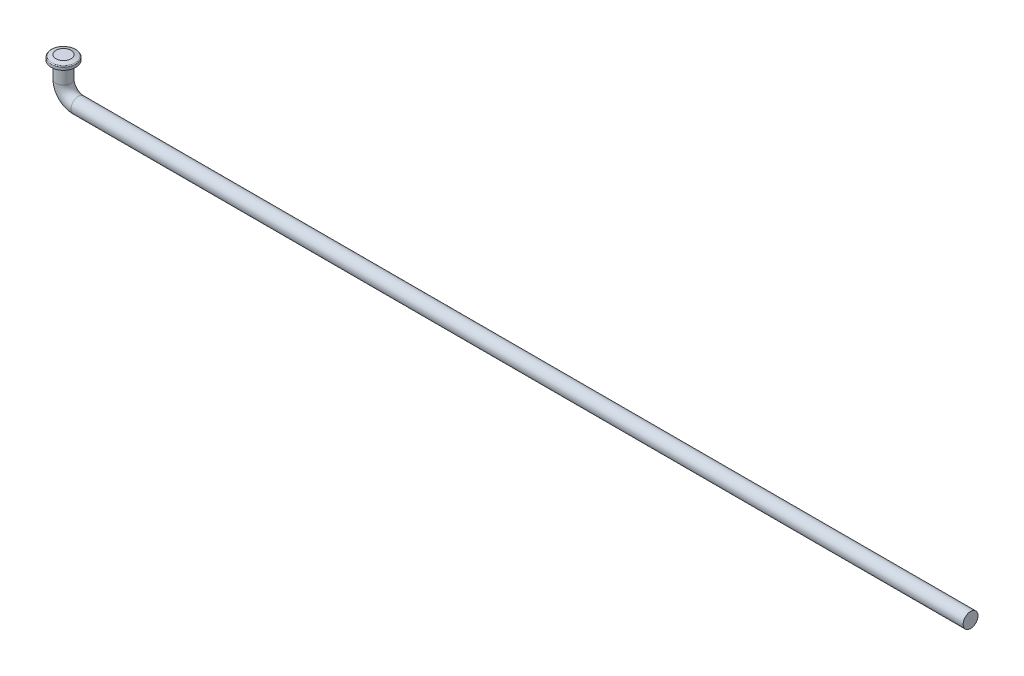
ISO-10303-21;
HEADER;
FILE_DESCRIPTION(('STEP AP214'),'2;1');
FILE_NAME('part.step','',(''),(''),'','','');
FILE_SCHEMA(('AUTOMOTIVE_DESIGN { 1 0 10303 214 1 1 1 1 }'));
ENDSEC;
DATA;
#1=APPLICATION_CONTEXT('core data for automotive mechanical design processes');
#2=APPLICATION_PROTOCOL_DEFINITION('international standard','automotive_design',2000,#1);
#3=PRODUCT_CONTEXT('',#1,'mechanical');
#4=PRODUCT('Part','Part','',(#3));
#5=PRODUCT_RELATED_PRODUCT_CATEGORY('part','',(#4));
#6=PRODUCT_DEFINITION_FORMATION('','',#4);
#7=PRODUCT_DEFINITION_CONTEXT('part definition',#1,'design');
#8=PRODUCT_DEFINITION('design','',#6,#7);
#9=PRODUCT_DEFINITION_SHAPE('','',#8);
#10=(LENGTH_UNIT() NAMED_UNIT(*) SI_UNIT(.MILLI.,.METRE.));
#11=(NAMED_UNIT(*) PLANE_ANGLE_UNIT() SI_UNIT($,.RADIAN.));
#12=(NAMED_UNIT(*) SI_UNIT($,.STERADIAN.) SOLID_ANGLE_UNIT());
#13=UNCERTAINTY_MEASURE_WITH_UNIT(LENGTH_MEASURE(1.E-05),#10,'distance_accuracy_value','');
#14=(GEOMETRIC_REPRESENTATION_CONTEXT(3) GLOBAL_UNCERTAINTY_ASSIGNED_CONTEXT((#13)) GLOBAL_UNIT_ASSIGNED_CONTEXT((#10,
#11,#12)) REPRESENTATION_CONTEXT('',''));
#15=CARTESIAN_POINT('',(0.,0.,0.));
#16=DIRECTION('',(0.,0.,1.));
#17=DIRECTION('',(1.,0.,0.));
#18=AXIS2_PLACEMENT_3D('',#15,#16,#17);
#19=CARTESIAN_POINT('',(-93.,6.85119386982182,0.));
#20=DIRECTION('',(0.,1.,0.));
#21=DIRECTION('',(-1.,0.,0.));
#22=AXIS2_PLACEMENT_3D('',#19,#20,#21);
#23=TOROIDAL_SURFACE('',#22,2.3,0.2);
#24=CARTESIAN_POINT('',(-93.,6.85119386982182,0.));
#25=DIRECTION('',(0.,1.,0.));
#26=DIRECTION('',(-1.,0.,0.));
#27=AXIS2_PLACEMENT_3D('',#24,#25,#26);
#28=CIRCLE('',#27,2.5);
#29=CARTESIAN_POINT('',(-95.5,6.85119386982182,0.));
#30=VERTEX_POINT('',#29);
#31=EDGE_CURVE('E60',#30,#30,#28,.F.);
#32=ORIENTED_EDGE('',*,*,#31,.F.);
#33=EDGE_LOOP('',(#32));
#34=FACE_BOUND('',#33,.T.);
#35=CARTESIAN_POINT('',(-93.,7.04275912686605,0.));
#36=DIRECTION('',(0.,-1.,0.));
#37=DIRECTION('',(0.,0.,-1.));
#38=AXIS2_PLACEMENT_3D('',#35,#36,#37);
#39=CIRCLE('',#38,2.35746957711326);
#40=CARTESIAN_POINT('',(-93.,7.04275912686605,-2.35746957711326));
#41=VERTEX_POINT('',#40);
#42=EDGE_CURVE('E12',#41,#41,#39,.F.);
#43=ORIENTED_EDGE('',*,*,#42,.F.);
#44=EDGE_LOOP('',(#43));
#45=FACE_BOUND('',#44,.T.);
#46=ADVANCED_FACE('F54',(#34,#45),#23,.T.);
#47=CARTESIAN_POINT('',(-93.,7.30000000000002,0.));
#48=DIRECTION('',(0.,-1.,0.));
#49=DIRECTION('',(1.,0.,0.));
#50=AXIS2_PLACEMENT_3D('',#47,#48,#49);
#51=CYLINDRICAL_SURFACE('',#50,2.5);
#52=ORIENTED_EDGE('',*,*,#31,.T.);
#53=EDGE_LOOP('',(#52));
#54=FACE_BOUND('',#53,.T.);
#55=CARTESIAN_POINT('',(-93.,6.30000000000002,0.));
#56=DIRECTION('',(0.,1.,0.));
#57=DIRECTION('',(0.,0.,1.));
#58=AXIS2_PLACEMENT_3D('',#55,#56,#57);
#59=CIRCLE('',#58,2.5);
#60=CARTESIAN_POINT('',(-93.,6.30000000000002,2.5));
#61=VERTEX_POINT('',#60);
#62=EDGE_CURVE('E68',#61,#61,#59,.T.);
#63=ORIENTED_EDGE('',*,*,#62,.T.);
#64=EDGE_LOOP('',(#63));
#65=FACE_BOUND('',#64,.T.);
#66=ADVANCED_FACE('F93',(#54,#65),#51,.T.);
#67=CARTESIAN_POINT('',(-93.,7.30000000000002,0.));
#68=DIRECTION('',(0.,1.,0.));
#69=DIRECTION('',(-1.,0.,0.));
#70=AXIS2_PLACEMENT_3D('',#67,#68,#69);
#71=PLANE('',#70);
#72=CARTESIAN_POINT('',(-93.,7.30000000000002,0.));
#73=DIRECTION('',(0.,1.,0.));
#74=DIRECTION('',(-1.,0.,0.));
#75=AXIS2_PLACEMENT_3D('',#72,#73,#74);
#76=CIRCLE('',#75,1.5);
#77=CARTESIAN_POINT('',(-94.5,7.30000000000002,0.));
#78=VERTEX_POINT('',#77);
#79=EDGE_CURVE('E73',#78,#78,#76,.T.);
#80=ORIENTED_EDGE('',*,*,#79,.T.);
#81=EDGE_LOOP('',(#80));
#82=FACE_BOUND('',#81,.T.);
#83=ADVANCED_FACE('F77',(#82),#71,.T.);
#84=CARTESIAN_POINT('',(-93.,6.00000000000002,0.));
#85=DIRECTION('',(0.,1.,0.));
#86=DIRECTION('',(-1.,0.,0.));
#87=AXIS2_PLACEMENT_3D('',#84,#85,#86);
#88=PLANE('',#87);
#89=CARTESIAN_POINT('',(-93.,6.00000000000002,0.));
#90=DIRECTION('',(0.,1.,0.));
#91=DIRECTION('',(-1.,0.,0.));
#92=AXIS2_PLACEMENT_3D('',#89,#90,#91);
#93=CIRCLE('',#92,1.71847328059185);
#94=CARTESIAN_POINT('',(-94.7184732805919,6.00000000000002,0.));
#95=VERTEX_POINT('',#94);
#96=EDGE_CURVE('E64',#95,#95,#93,.F.);
#97=ORIENTED_EDGE('',*,*,#96,.T.);
#98=EDGE_LOOP('',(#97));
#99=FACE_BOUND('',#98,.T.);
#100=ADVANCED_FACE('F82',(#99),#88,.F.);
#101=CARTESIAN_POINT('',(-93.,7.30000000000002,0.));
#102=DIRECTION('',(0.,-1.,0.));
#103=DIRECTION('',(0.,0.,-1.));
#104=AXIS2_PLACEMENT_3D('',#101,#102,#103);
#105=CONICAL_SURFACE('',#104,1.5,1.27933953231703);
#106=ORIENTED_EDGE('',*,*,#42,.T.);
#107=EDGE_LOOP('',(#106));
#108=FACE_BOUND('',#107,.T.);
#109=ORIENTED_EDGE('',*,*,#79,.F.);
#110=EDGE_LOOP('',(#109));
#111=FACE_BOUND('',#110,.T.);
#112=ADVANCED_FACE('F79',(#108,#111),#105,.T.);
#113=CARTESIAN_POINT('',(-93.,6.30000000000002,0.));
#114=DIRECTION('',(0.,1.,0.));
#115=DIRECTION('',(0.,0.,1.));
#116=AXIS2_PLACEMENT_3D('',#113,#114,#115);
#117=CONICAL_SURFACE('',#116,2.5,1.20427718387609);
#118=ORIENTED_EDGE('',*,*,#96,.F.);
#119=EDGE_LOOP('',(#118));
#120=FACE_BOUND('',#119,.T.);
#121=ORIENTED_EDGE('',*,*,#62,.F.);
#122=EDGE_LOOP('',(#121));
#123=FACE_BOUND('',#122,.T.);
#124=ADVANCED_FACE('F81',(#120,#123),#117,.T.);
#125=CLOSED_SHELL('',(#46,#66,#83,#100,#112,#124));
#126=MANIFOLD_SOLID_BREP('B2',#125);
#127=CARTESIAN_POINT('',(-93.,3.00000000000001,0.));
#128=DIRECTION('',(0.,1.,0.));
#129=DIRECTION('',(0.,0.,1.));
#130=AXIS2_PLACEMENT_3D('',#127,#128,#129);
#131=CYLINDRICAL_SURFACE('',#130,1.5);
#132=CARTESIAN_POINT('',(-93.,6.00000000000001,0.));
#133=DIRECTION('',(0.,-1.,0.));
#134=DIRECTION('',(1.,0.,0.));
#135=AXIS2_PLACEMENT_3D('',#132,#133,#134);
#136=CIRCLE('',#135,1.5);
#137=CARTESIAN_POINT('',(-91.5,6.00000000000001,0.));
#138=VERTEX_POINT('',#137);
#139=EDGE_CURVE('E146',#138,#138,#136,.T.);
#140=ORIENTED_EDGE('',*,*,#139,.T.);
#141=EDGE_LOOP('',(#140));
#142=FACE_BOUND('',#141,.T.);
#143=CARTESIAN_POINT('',(-93.,3.,0.));
#144=DIRECTION('',(0.,-1.,0.));
#145=DIRECTION('',(1.,0.,0.));
#146=AXIS2_PLACEMENT_3D('',#143,#144,#145);
#147=CIRCLE('',#146,1.5);
#148=CARTESIAN_POINT('',(-94.5,3.,0.));
#149=VERTEX_POINT('',#148);
#150=EDGE_CURVE('E53',#149,#149,#147,.T.);
#151=ORIENTED_EDGE('',*,*,#150,.F.);
#152=EDGE_LOOP('',(#151));
#153=FACE_BOUND('',#152,.T.);
#154=ADVANCED_FACE('F140',(#142,#153),#131,.T.);
#155=CARTESIAN_POINT('',(-93.,6.00000000000001,0.));
#156=DIRECTION('',(0.,-1.,0.));
#157=DIRECTION('',(1.,0.,0.));
#158=AXIS2_PLACEMENT_3D('',#155,#156,#157);
#159=PLANE('',#158);
#160=ORIENTED_EDGE('',*,*,#139,.F.);
#161=EDGE_LOOP('',(#160));
#162=FACE_BOUND('',#161,.T.);
#163=ADVANCED_FACE('F170',(#162),#159,.F.);
#164=CARTESIAN_POINT('',(-90.,3.,0.));
#165=DIRECTION('',(0.,0.,-1.));
#166=DIRECTION('',(-1.,0.,0.));
#167=AXIS2_PLACEMENT_3D('',#164,#165,#166);
#168=TOROIDAL_SURFACE('',#167,3.,1.5);
#169=CARTESIAN_POINT('',(-90.,0.,0.));
#170=DIRECTION('',(1.,0.,0.));
#171=DIRECTION('',(0.,1.,0.));
#172=AXIS2_PLACEMENT_3D('',#169,#170,#171);
#173=CIRCLE('',#172,1.5);
#174=CARTESIAN_POINT('',(-90.,-1.5,0.));
#175=VERTEX_POINT('',#174);
#176=EDGE_CURVE('E150',#175,#175,#173,.T.);
#177=CARTESIAN_POINT('',(-90.,3.,0.));
#178=DIRECTION('',(0.,0.,-1.));
#179=DIRECTION('',(-1.,0.,0.));
#180=AXIS2_PLACEMENT_3D('',#177,#178,#179);
#181=CIRCLE('',#180,4.5);
#182=EDGE_CURVE('',#175,#149,#181,.T.);
#183=ORIENTED_EDGE('',*,*,#176,.F.);
#184=ORIENTED_EDGE('',*,*,#150,.T.);
#185=ORIENTED_EDGE('',*,*,#182,.T.);
#186=ORIENTED_EDGE('',*,*,#182,.F.);
#187=EDGE_LOOP('',(#183,#185,#184,#186));
#188=FACE_BOUND('',#187,.T.);
#189=ADVANCED_FACE('F165',(#188),#168,.T.);
#190=CARTESIAN_POINT('',(90.,0.,0.));
#191=DIRECTION('',(-1.,0.,0.));
#192=DIRECTION('',(0.,-1.,0.));
#193=AXIS2_PLACEMENT_3D('',#190,#191,#192);
#194=CYLINDRICAL_SURFACE('',#193,1.5);
#195=CARTESIAN_POINT('',(90.,0.,0.));
#196=DIRECTION('',(1.,0.,0.));
#197=DIRECTION('',(0.,1.,0.));
#198=AXIS2_PLACEMENT_3D('',#195,#196,#197);
#199=CIRCLE('',#198,1.5);
#200=CARTESIAN_POINT('',(90.,-1.49999999999997,0.));
#201=VERTEX_POINT('',#200);
#202=EDGE_CURVE('E154',#201,#201,#199,.T.);
#203=CARTESIAN_POINT('',(90.,-1.49999999999997,0.));
#204=CARTESIAN_POINT('',(88.125,-1.49999999999997,0.));
#205=CARTESIAN_POINT('',(86.25,-1.49999999999997,0.));
#206=CARTESIAN_POINT('',(82.5,-1.49999999999997,0.));
#207=CARTESIAN_POINT('',(80.625,-1.49999999999997,0.));
#208=CARTESIAN_POINT('',(76.875,-1.49999999999997,0.));
#209=CARTESIAN_POINT('',(75.,-1.49999999999997,0.));
#210=CARTESIAN_POINT('',(71.25,-1.49999999999997,0.));
#211=CARTESIAN_POINT('',(69.375,-1.49999999999997,0.));
#212=CARTESIAN_POINT('',(65.625,-1.49999999999997,0.));
#213=CARTESIAN_POINT('',(63.75,-1.49999999999997,0.));
#214=CARTESIAN_POINT('',(60.,-1.49999999999997,0.));
#215=CARTESIAN_POINT('',(58.125,-1.49999999999997,0.));
#216=CARTESIAN_POINT('',(54.375,-1.49999999999997,0.));
#217=CARTESIAN_POINT('',(52.5,-1.49999999999997,0.));
#218=CARTESIAN_POINT('',(48.75,-1.49999999999997,0.));
#219=CARTESIAN_POINT('',(46.875,-1.49999999999998,0.));
#220=CARTESIAN_POINT('',(43.125,-1.49999999999998,0.));
#221=CARTESIAN_POINT('',(41.25,-1.49999999999998,0.));
#222=CARTESIAN_POINT('',(37.5,-1.49999999999998,0.));
#223=CARTESIAN_POINT('',(35.625,-1.49999999999998,0.));
#224=CARTESIAN_POINT('',(31.875,-1.49999999999998,0.));
#225=CARTESIAN_POINT('',(30.,-1.49999999999998,0.));
#226=CARTESIAN_POINT('',(26.25,-1.49999999999998,0.));
#227=CARTESIAN_POINT('',(24.375,-1.49999999999998,0.));
#228=CARTESIAN_POINT('',(20.625,-1.49999999999998,0.));
#229=CARTESIAN_POINT('',(18.75,-1.49999999999998,0.));
#230=CARTESIAN_POINT('',(15.,-1.49999999999998,0.));
#231=CARTESIAN_POINT('',(13.125,-1.49999999999998,0.));
#232=CARTESIAN_POINT('',(9.37500000000003,-1.49999999999998,0.));
#233=CARTESIAN_POINT('',(7.50000000000003,-1.49999999999998,0.));
#234=CARTESIAN_POINT('',(3.75000000000003,-1.49999999999998,0.));
#235=CARTESIAN_POINT('',(1.87500000000003,-1.49999999999998,0.));
#236=CARTESIAN_POINT('',(-1.87499999999997,-1.49999999999998,0.));
#237=CARTESIAN_POINT('',(-3.74999999999998,-1.49999999999998,0.));
#238=CARTESIAN_POINT('',(-7.49999999999997,-1.49999999999999,0.));
#239=CARTESIAN_POINT('',(-9.37499999999997,-1.49999999999999,0.));
#240=CARTESIAN_POINT('',(-13.125,-1.49999999999999,0.));
#241=CARTESIAN_POINT('',(-15.,-1.49999999999999,0.));
#242=CARTESIAN_POINT('',(-18.75,-1.49999999999999,0.));
#243=CARTESIAN_POINT('',(-20.625,-1.49999999999999,0.));
#244=CARTESIAN_POINT('',(-24.375,-1.49999999999999,0.));
#245=CARTESIAN_POINT('',(-26.25,-1.49999999999999,0.));
#246=CARTESIAN_POINT('',(-30.,-1.49999999999999,0.));
#247=CARTESIAN_POINT('',(-31.875,-1.49999999999999,0.));
#248=CARTESIAN_POINT('',(-35.625,-1.49999999999999,0.));
#249=CARTESIAN_POINT('',(-37.5,-1.49999999999999,0.));
#250=CARTESIAN_POINT('',(-41.25,-1.49999999999999,0.));
#251=CARTESIAN_POINT('',(-43.125,-1.49999999999999,0.));
#252=CARTESIAN_POINT('',(-46.875,-1.49999999999999,0.));
#253=CARTESIAN_POINT('',(-48.75,-1.49999999999999,0.));
#254=CARTESIAN_POINT('',(-52.5,-1.49999999999999,0.));
#255=CARTESIAN_POINT('',(-54.375,-1.49999999999999,0.));
#256=CARTESIAN_POINT('',(-58.125,-1.49999999999999,0.));
#257=CARTESIAN_POINT('',(-60.,-1.5,0.));
#258=CARTESIAN_POINT('',(-63.75,-1.5,0.));
#259=CARTESIAN_POINT('',(-65.625,-1.5,0.));
#260=CARTESIAN_POINT('',(-69.375,-1.5,0.));
#261=CARTESIAN_POINT('',(-71.25,-1.5,0.));
#262=CARTESIAN_POINT('',(-75.,-1.5,0.));
#263=CARTESIAN_POINT('',(-76.875,-1.5,0.));
#264=CARTESIAN_POINT('',(-80.625,-1.5,0.));
#265=CARTESIAN_POINT('',(-82.5,-1.5,0.));
#266=CARTESIAN_POINT('',(-86.25,-1.5,0.));
#267=CARTESIAN_POINT('',(-88.125,-1.5,0.));
#268=CARTESIAN_POINT('',(-90.,-1.5,0.));
#269=B_SPLINE_CURVE_WITH_KNOTS('',3,(#203,#204,#205,#206,#207,#208,#209,#210,#211,#212,#213,
#214,#215,#216,#217,#218,#219,#220,#221,#222,#223,#224,#225,#226,#227,#228,#229,#230,#231,#232,
#233,#234,#235,#236,#237,#238,#239,#240,#241,#242,#243,#244,#245,#246,#247,#248,#249,#250,#251,
#252,#253,#254,#255,#256,#257,#258,#259,#260,#261,#262,#263,#264,#265,#266,#267,#268),
.UNSPECIFIED.,.F.,.F.,(4,2,2,2,2,2,2,2,2,2,2,2,2,2,2,2,2,2,2,2,2,2,2,2,2,2,2,2,2,2,2,2,4),(0.,
5.62500000000001,11.25,16.875,22.5,28.125,33.75,39.375,45.,50.625,56.25,61.875,67.5,73.125,
78.75,84.375,90.,95.625,101.25,106.875,112.5,118.125,123.75,129.375,135.,140.625,146.25,151.875,
157.5,163.125,168.75,174.375,180.),.UNSPECIFIED.);
#270=EDGE_CURVE('BSEAM162',#201,#175,#269,.T.);
#271=ORIENTED_EDGE('',*,*,#202,.F.);
#272=ORIENTED_EDGE('',*,*,#176,.T.);
#273=ORIENTED_EDGE('',*,*,#270,.T.);
#274=ORIENTED_EDGE('',*,*,#270,.F.);
#275=EDGE_LOOP('',(#271,#273,#272,#274));
#276=FACE_BOUND('',#275,.T.);
#277=ADVANCED_FACE('F162',(#276),#194,.T.);
#278=CARTESIAN_POINT('',(90.,0.,0.));
#279=DIRECTION('',(1.,0.,0.));
#280=DIRECTION('',(0.,1.,0.));
#281=AXIS2_PLACEMENT_3D('',#278,#279,#280);
#282=PLANE('',#281);
#283=ORIENTED_EDGE('',*,*,#202,.T.);
#284=EDGE_LOOP('',(#283));
#285=FACE_BOUND('',#284,.T.);
#286=ADVANCED_FACE('F160',(#285),#282,.T.);
#287=CLOSED_SHELL('',(#154,#163,#189,#277,#286));
#288=MANIFOLD_SOLID_BREP('B7',#287);
#289=ADVANCED_BREP_SHAPE_REPRESENTATION('',(#18,#126,#288),#14);
#290=SHAPE_DEFINITION_REPRESENTATION(#9,#289);
ENDSEC;
END-ISO-10303-21;
